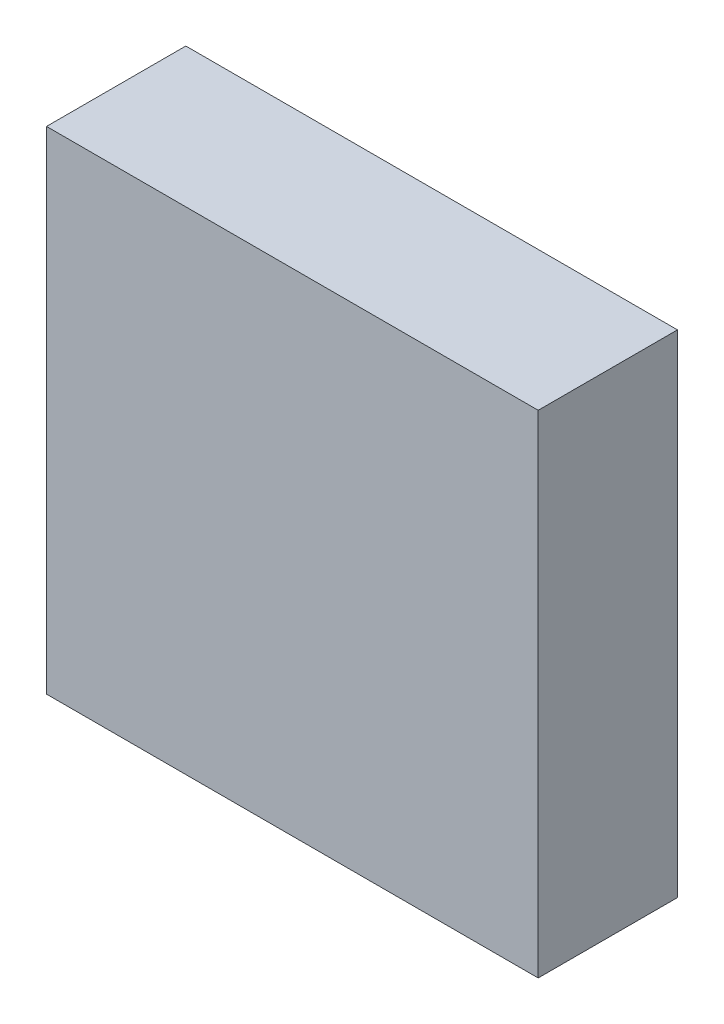
ISO-10303-21;
HEADER;
FILE_DESCRIPTION(('STEP AP214'),'2;1');
FILE_NAME('part.step','',(''),(''),'','','');
FILE_SCHEMA(('AUTOMOTIVE_DESIGN { 1 0 10303 214 1 1 1 1 }'));
ENDSEC;
DATA;
#1=APPLICATION_CONTEXT('core data for automotive mechanical design processes');
#2=APPLICATION_PROTOCOL_DEFINITION('international standard','automotive_design',2000,#1);
#3=PRODUCT_CONTEXT('',#1,'mechanical');
#4=PRODUCT('Part','Part','',(#3));
#5=PRODUCT_RELATED_PRODUCT_CATEGORY('part','',(#4));
#6=PRODUCT_DEFINITION_FORMATION('','',#4);
#7=PRODUCT_DEFINITION_CONTEXT('part definition',#1,'design');
#8=PRODUCT_DEFINITION('design','',#6,#7);
#9=PRODUCT_DEFINITION_SHAPE('','',#8);
#10=(LENGTH_UNIT() NAMED_UNIT(*) SI_UNIT(.MILLI.,.METRE.));
#11=(NAMED_UNIT(*) PLANE_ANGLE_UNIT() SI_UNIT($,.RADIAN.));
#12=(NAMED_UNIT(*) SI_UNIT($,.STERADIAN.) SOLID_ANGLE_UNIT());
#13=UNCERTAINTY_MEASURE_WITH_UNIT(LENGTH_MEASURE(1.E-05),#10,'distance_accuracy_value','');
#14=(GEOMETRIC_REPRESENTATION_CONTEXT(3) GLOBAL_UNCERTAINTY_ASSIGNED_CONTEXT((#13)) GLOBAL_UNIT_ASSIGNED_CONTEXT((#10,
#11,#12)) REPRESENTATION_CONTEXT('',''));
#15=CARTESIAN_POINT('',(0.,0.,0.));
#16=DIRECTION('',(0.,0.,1.));
#17=DIRECTION('',(1.,0.,0.));
#18=AXIS2_PLACEMENT_3D('',#15,#16,#17);
#19=CARTESIAN_POINT('',(-17.65,-17.65,10.));
#20=DIRECTION('',(-1.,0.,0.));
#21=DIRECTION('',(0.,0.,1.));
#22=AXIS2_PLACEMENT_3D('',#19,#20,#21);
#23=PLANE('',#22);
#24=DIRECTION('',(0.,1.,0.));
#25=VECTOR('',#24,1.);
#26=CARTESIAN_POINT('',(-17.65,-17.65,0.));
#27=LINE('',#26,#25);
#28=CARTESIAN_POINT('',(-17.65,-17.65,0.));
#29=VERTEX_POINT('',#28);
#30=CARTESIAN_POINT('',(-17.65,17.65,0.));
#31=VERTEX_POINT('',#30);
#32=EDGE_CURVE('E106',#29,#31,#27,.T.);
#33=ORIENTED_EDGE('',*,*,#32,.F.);
#34=DIRECTION('',(0.,0.,-1.));
#35=VECTOR('',#34,1.);
#36=CARTESIAN_POINT('',(-17.65,-17.65,10.));
#37=LINE('',#36,#35);
#38=CARTESIAN_POINT('',(-17.65,-17.65,10.));
#39=VERTEX_POINT('',#38);
#40=EDGE_CURVE('E11',#39,#29,#37,.T.);
#41=ORIENTED_EDGE('',*,*,#40,.F.);
#42=DIRECTION('',(0.,1.,0.));
#43=VECTOR('',#42,1.);
#44=CARTESIAN_POINT('',(-17.65,-17.65,10.));
#45=LINE('',#44,#43);
#46=CARTESIAN_POINT('',(-17.65,17.65,10.));
#47=VERTEX_POINT('',#46);
#48=EDGE_CURVE('E101',#39,#47,#45,.T.);
#49=ORIENTED_EDGE('',*,*,#48,.T.);
#50=DIRECTION('',(0.,0.,-1.));
#51=VECTOR('',#50,1.);
#52=CARTESIAN_POINT('',(-17.65,17.65,10.));
#53=LINE('',#52,#51);
#54=EDGE_CURVE('E44',#47,#31,#53,.T.);
#55=ORIENTED_EDGE('',*,*,#54,.T.);
#56=EDGE_LOOP('',(#33,#41,#49,#55));
#57=FACE_BOUND('',#56,.T.);
#58=ADVANCED_FACE('F41',(#57),#23,.T.);
#59=CARTESIAN_POINT('',(-17.65,-17.65,10.));
#60=DIRECTION('',(0.,1.,0.));
#61=DIRECTION('',(0.,0.,1.));
#62=AXIS2_PLACEMENT_3D('',#59,#60,#61);
#63=PLANE('',#62);
#64=DIRECTION('',(1.,0.,0.));
#65=VECTOR('',#64,1.);
#66=CARTESIAN_POINT('',(-17.65,-17.65,0.));
#67=LINE('',#66,#65);
#68=CARTESIAN_POINT('',(17.65,-17.65,0.));
#69=VERTEX_POINT('',#68);
#70=EDGE_CURVE('E74',#29,#69,#67,.T.);
#71=ORIENTED_EDGE('',*,*,#70,.T.);
#72=DIRECTION('',(0.,0.,-1.));
#73=VECTOR('',#72,1.);
#74=CARTESIAN_POINT('',(17.65,-17.65,10.));
#75=LINE('',#74,#73);
#76=CARTESIAN_POINT('',(17.65,-17.65,10.));
#77=VERTEX_POINT('',#76);
#78=EDGE_CURVE('E50',#77,#69,#75,.T.);
#79=ORIENTED_EDGE('',*,*,#78,.F.);
#80=DIRECTION('',(1.,0.,0.));
#81=VECTOR('',#80,1.);
#82=CARTESIAN_POINT('',(-17.65,-17.65,10.));
#83=LINE('',#82,#81);
#84=EDGE_CURVE('E91',#39,#77,#83,.T.);
#85=ORIENTED_EDGE('',*,*,#84,.F.);
#86=ORIENTED_EDGE('',*,*,#40,.T.);
#87=EDGE_LOOP('',(#71,#79,#85,#86));
#88=FACE_BOUND('',#87,.T.);
#89=ADVANCED_FACE('F116',(#88),#63,.F.);
#90=CARTESIAN_POINT('',(17.65,-17.65,10.));
#91=DIRECTION('',(-1.,0.,0.));
#92=DIRECTION('',(0.,0.,1.));
#93=AXIS2_PLACEMENT_3D('',#90,#91,#92);
#94=PLANE('',#93);
#95=DIRECTION('',(0.,1.,0.));
#96=VECTOR('',#95,1.);
#97=CARTESIAN_POINT('',(17.65,-17.65,0.));
#98=LINE('',#97,#96);
#99=CARTESIAN_POINT('',(17.65,17.65,0.));
#100=VERTEX_POINT('',#99);
#101=EDGE_CURVE('E98',#69,#100,#98,.T.);
#102=ORIENTED_EDGE('',*,*,#101,.T.);
#103=DIRECTION('',(0.,0.,-1.));
#104=VECTOR('',#103,1.);
#105=CARTESIAN_POINT('',(17.65,17.65,10.));
#106=LINE('',#105,#104);
#107=CARTESIAN_POINT('',(17.65,17.65,10.));
#108=VERTEX_POINT('',#107);
#109=EDGE_CURVE('E95',#108,#100,#106,.T.);
#110=ORIENTED_EDGE('',*,*,#109,.F.);
#111=DIRECTION('',(0.,1.,0.));
#112=VECTOR('',#111,1.);
#113=CARTESIAN_POINT('',(17.65,-17.65,10.));
#114=LINE('',#113,#112);
#115=EDGE_CURVE('E86',#77,#108,#114,.T.);
#116=ORIENTED_EDGE('',*,*,#115,.F.);
#117=ORIENTED_EDGE('',*,*,#78,.T.);
#118=EDGE_LOOP('',(#102,#110,#116,#117));
#119=FACE_BOUND('',#118,.T.);
#120=ADVANCED_FACE('F96',(#119),#94,.F.);
#121=CARTESIAN_POINT('',(-17.65,17.65,10.));
#122=DIRECTION('',(0.,1.,0.));
#123=DIRECTION('',(0.,0.,1.));
#124=AXIS2_PLACEMENT_3D('',#121,#122,#123);
#125=PLANE('',#124);
#126=DIRECTION('',(1.,0.,0.));
#127=VECTOR('',#126,1.);
#128=CARTESIAN_POINT('',(-17.65,17.65,0.));
#129=LINE('',#128,#127);
#130=EDGE_CURVE('E109',#31,#100,#129,.T.);
#131=ORIENTED_EDGE('',*,*,#130,.F.);
#132=ORIENTED_EDGE('',*,*,#54,.F.);
#133=DIRECTION('',(1.,0.,0.));
#134=VECTOR('',#133,1.);
#135=CARTESIAN_POINT('',(-17.65,17.65,10.));
#136=LINE('',#135,#134);
#137=EDGE_CURVE('E90',#47,#108,#136,.T.);
#138=ORIENTED_EDGE('',*,*,#137,.T.);
#139=ORIENTED_EDGE('',*,*,#109,.T.);
#140=EDGE_LOOP('',(#131,#132,#138,#139));
#141=FACE_BOUND('',#140,.T.);
#142=ADVANCED_FACE('F100',(#141),#125,.T.);
#143=CARTESIAN_POINT('',(0.,0.,10.));
#144=DIRECTION('',(0.,0.,-1.));
#145=DIRECTION('',(-1.,0.,0.));
#146=AXIS2_PLACEMENT_3D('',#143,#144,#145);
#147=PLANE('',#146);
#148=ORIENTED_EDGE('',*,*,#48,.F.);
#149=ORIENTED_EDGE('',*,*,#84,.T.);
#150=ORIENTED_EDGE('',*,*,#115,.T.);
#151=ORIENTED_EDGE('',*,*,#137,.F.);
#152=EDGE_LOOP('',(#148,#149,#150,#151));
#153=FACE_BOUND('',#152,.T.);
#154=ADVANCED_FACE('F89',(#153),#147,.F.);
#155=CARTESIAN_POINT('',(0.,0.,0.));
#156=DIRECTION('',(0.,0.,-1.));
#157=DIRECTION('',(-1.,0.,0.));
#158=AXIS2_PLACEMENT_3D('',#155,#156,#157);
#159=PLANE('',#158);
#160=ORIENTED_EDGE('',*,*,#32,.T.);
#161=ORIENTED_EDGE('',*,*,#130,.T.);
#162=ORIENTED_EDGE('',*,*,#101,.F.);
#163=ORIENTED_EDGE('',*,*,#70,.F.);
#164=EDGE_LOOP('',(#160,#161,#162,#163));
#165=FACE_BOUND('',#164,.T.);
#166=ADVANCED_FACE('F114',(#165),#159,.T.);
#167=CLOSED_SHELL('',(#58,#89,#120,#142,#154,#166));
#168=MANIFOLD_SOLID_BREP('B2',#167);
#169=ADVANCED_BREP_SHAPE_REPRESENTATION('',(#18,#168),#14);
#170=SHAPE_DEFINITION_REPRESENTATION(#9,#169);
ENDSEC;
END-ISO-10303-21;
